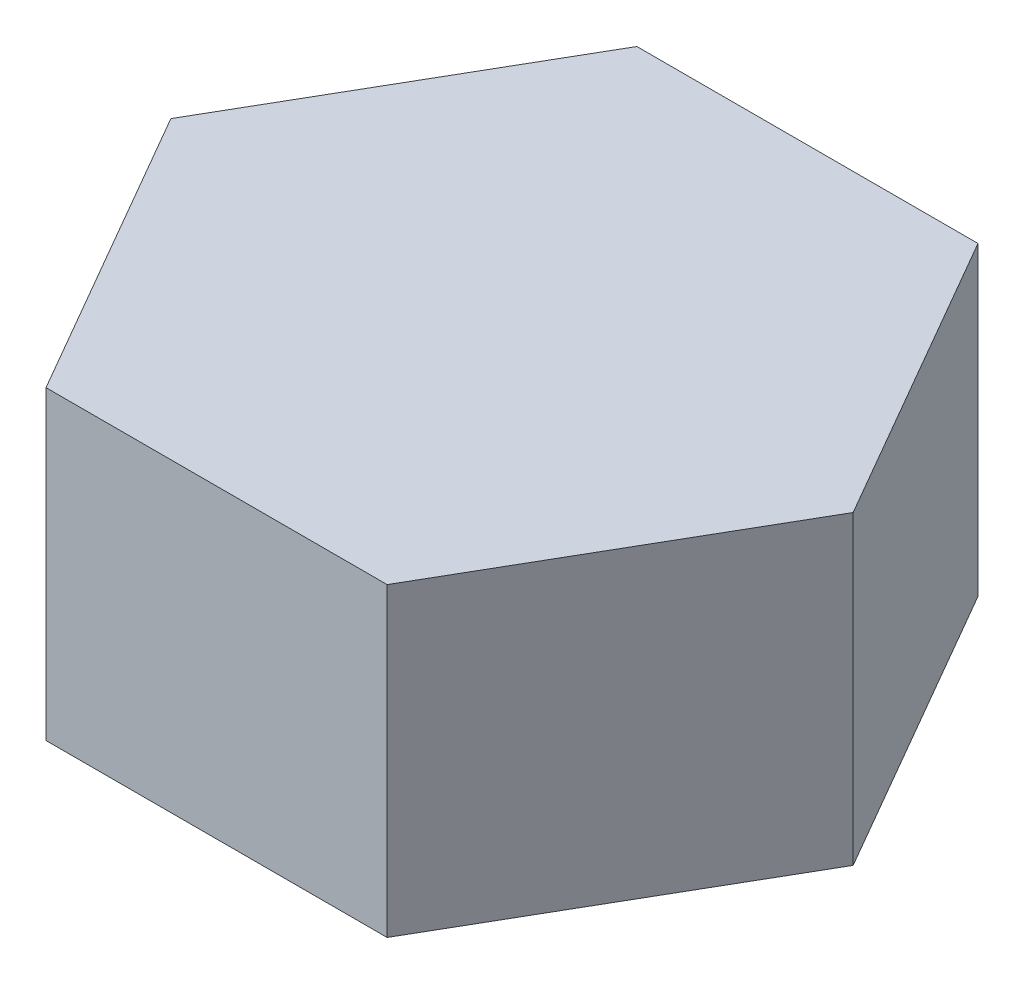
ISO-10303-21;
HEADER;
FILE_DESCRIPTION(('STEP AP214'),'2;1');
FILE_NAME('part.step','',(''),(''),'','','');
FILE_SCHEMA(('AUTOMOTIVE_DESIGN { 1 0 10303 214 1 1 1 1 }'));
ENDSEC;
DATA;
#1=APPLICATION_CONTEXT('core data for automotive mechanical design processes');
#2=APPLICATION_PROTOCOL_DEFINITION('international standard','automotive_design',2000,#1);
#3=PRODUCT_CONTEXT('',#1,'mechanical');
#4=PRODUCT('Part','Part','',(#3));
#5=PRODUCT_RELATED_PRODUCT_CATEGORY('part','',(#4));
#6=PRODUCT_DEFINITION_FORMATION('','',#4);
#7=PRODUCT_DEFINITION_CONTEXT('part definition',#1,'design');
#8=PRODUCT_DEFINITION('design','',#6,#7);
#9=PRODUCT_DEFINITION_SHAPE('','',#8);
#10=(LENGTH_UNIT() NAMED_UNIT(*) SI_UNIT(.MILLI.,.METRE.));
#11=(NAMED_UNIT(*) PLANE_ANGLE_UNIT() SI_UNIT($,.RADIAN.));
#12=(NAMED_UNIT(*) SI_UNIT($,.STERADIAN.) SOLID_ANGLE_UNIT());
#13=UNCERTAINTY_MEASURE_WITH_UNIT(LENGTH_MEASURE(1.E-05),#10,'distance_accuracy_value','');
#14=(GEOMETRIC_REPRESENTATION_CONTEXT(3) GLOBAL_UNCERTAINTY_ASSIGNED_CONTEXT((#13)) GLOBAL_UNIT_ASSIGNED_CONTEXT((#10,
#11,#12)) REPRESENTATION_CONTEXT('',''));
#15=CARTESIAN_POINT('',(0.,0.,0.));
#16=DIRECTION('',(0.,0.,1.));
#17=DIRECTION('',(1.,0.,0.));
#18=AXIS2_PLACEMENT_3D('',#15,#16,#17);
#19=CARTESIAN_POINT('',(-200.,0.,0.));
#20=DIRECTION('',(0.,1.,0.));
#21=DIRECTION('',(0.,0.,1.));
#22=AXIS2_PLACEMENT_3D('',#19,#20,#21);
#23=PLANE('',#22);
#24=DIRECTION('',(0.5,0.,-0.866025403784439));
#25=VECTOR('',#24,1.);
#26=CARTESIAN_POINT('',(-41.8578945162482,0.,-72.5));
#27=LINE('',#26,#25);
#28=CARTESIAN_POINT('',(-83.715789032496,0.,0.));
#29=VERTEX_POINT('',#28);
#30=CARTESIAN_POINT('',(-41.8578945162482,0.,-72.5));
#31=VERTEX_POINT('',#30);
#32=EDGE_CURVE('E50',#29,#31,#27,.T.);
#33=ORIENTED_EDGE('',*,*,#32,.T.);
#34=DIRECTION('',(1.,0.,0.));
#35=VECTOR('',#34,1.);
#36=CARTESIAN_POINT('',(41.8578945162476,0.,-72.5));
#37=LINE('',#36,#35);
#38=CARTESIAN_POINT('',(41.8578945162476,0.,-72.5));
#39=VERTEX_POINT('',#38);
#40=EDGE_CURVE('E220',#31,#39,#37,.T.);
#41=ORIENTED_EDGE('',*,*,#40,.T.);
#42=DIRECTION('',(0.5,0.,0.866025403784439));
#43=VECTOR('',#42,1.);
#44=CARTESIAN_POINT('',(83.7157890324954,0.,0.));
#45=LINE('',#44,#43);
#46=CARTESIAN_POINT('',(83.7157890324954,0.,0.));
#47=VERTEX_POINT('',#46);
#48=EDGE_CURVE('E217',#39,#47,#45,.T.);
#49=ORIENTED_EDGE('',*,*,#48,.T.);
#50=DIRECTION('',(-0.5,0.,0.866025403784439));
#51=VECTOR('',#50,1.);
#52=CARTESIAN_POINT('',(41.8578945162476,0.,72.5));
#53=LINE('',#52,#51);
#54=CARTESIAN_POINT('',(41.8578945162476,0.,72.5));
#55=VERTEX_POINT('',#54);
#56=EDGE_CURVE('E66',#47,#55,#53,.T.);
#57=ORIENTED_EDGE('',*,*,#56,.T.);
#58=DIRECTION('',(-1.,0.,0.));
#59=VECTOR('',#58,1.);
#60=CARTESIAN_POINT('',(-41.8578945162482,0.,72.5));
#61=LINE('',#60,#59);
#62=CARTESIAN_POINT('',(-41.8578945162482,0.,72.5));
#63=VERTEX_POINT('',#62);
#64=EDGE_CURVE('E211',#55,#63,#61,.T.);
#65=ORIENTED_EDGE('',*,*,#64,.T.);
#66=DIRECTION('',(-0.5,0.,-0.866025403784439));
#67=VECTOR('',#66,1.);
#68=CARTESIAN_POINT('',(-83.715789032496,0.,0.));
#69=LINE('',#68,#67);
#70=EDGE_CURVE('E11',#63,#29,#69,.T.);
#71=ORIENTED_EDGE('',*,*,#70,.T.);
#72=EDGE_LOOP('',(#33,#41,#49,#57,#65,#71));
#73=FACE_BOUND('',#72,.T.);
#74=DIRECTION('',(0.499999999999999,0.,-0.866025403784439));
#75=VECTOR('',#74,1.);
#76=CARTESIAN_POINT('',(36.0843918243516,0.,62.5));
#77=LINE('',#76,#75);
#78=CARTESIAN_POINT('',(36.0843918243516,0.,62.5));
#79=VERTEX_POINT('',#78);
#80=CARTESIAN_POINT('',(72.1687836487032,0.,0.));
#81=VERTEX_POINT('',#80);
#82=EDGE_CURVE('E57',#79,#81,#77,.T.);
#83=ORIENTED_EDGE('',*,*,#82,.T.);
#84=DIRECTION('',(-0.5,0.,-0.866025403784438));
#85=VECTOR('',#84,1.);
#86=CARTESIAN_POINT('',(72.1687836487032,0.,0.));
#87=LINE('',#86,#85);
#88=CARTESIAN_POINT('',(36.0843918243516,0.,-62.5));
#89=VERTEX_POINT('',#88);
#90=EDGE_CURVE('E590',#81,#89,#87,.T.);
#91=ORIENTED_EDGE('',*,*,#90,.T.);
#92=DIRECTION('',(-1.,0.,0.));
#93=VECTOR('',#92,1.);
#94=CARTESIAN_POINT('',(36.0843918243516,0.,-62.5));
#95=LINE('',#94,#93);
#96=CARTESIAN_POINT('',(-36.0843918243516,0.,-62.5));
#97=VERTEX_POINT('',#96);
#98=EDGE_CURVE('E586',#89,#97,#95,.T.);
#99=ORIENTED_EDGE('',*,*,#98,.T.);
#100=DIRECTION('',(-0.499999999999999,0.,0.866025403784439));
#101=VECTOR('',#100,1.);
#102=CARTESIAN_POINT('',(-36.0843918243516,0.,-62.5));
#103=LINE('',#102,#101);
#104=CARTESIAN_POINT('',(-72.1687836487032,0.,0.));
#105=VERTEX_POINT('',#104);
#106=EDGE_CURVE('E582',#97,#105,#103,.T.);
#107=ORIENTED_EDGE('',*,*,#106,.T.);
#108=DIRECTION('',(0.5,0.,0.866025403784438));
#109=VECTOR('',#108,1.);
#110=CARTESIAN_POINT('',(-72.1687836487032,0.,0.));
#111=LINE('',#110,#109);
#112=CARTESIAN_POINT('',(-36.0843918243516,0.,62.5));
#113=VERTEX_POINT('',#112);
#114=EDGE_CURVE('E578',#105,#113,#111,.T.);
#115=ORIENTED_EDGE('',*,*,#114,.T.);
#116=DIRECTION('',(1.,0.,0.));
#117=VECTOR('',#116,1.);
#118=CARTESIAN_POINT('',(-36.0843918243516,0.,62.5));
#119=LINE('',#118,#117);
#120=EDGE_CURVE('E141',#113,#79,#119,.T.);
#121=ORIENTED_EDGE('',*,*,#120,.T.);
#122=EDGE_LOOP('',(#83,#91,#99,#107,#115,#121));
#123=FACE_BOUND('',#122,.T.);
#124=ADVANCED_FACE('F41',(#73,#123),#23,.F.);
#125=CARTESIAN_POINT('',(-41.8578945162482,-221.491158589532,-72.5));
#126=DIRECTION('',(-0.866025403784438,0.,-0.5));
#127=DIRECTION('',(-0.5,0.,0.866025403784439));
#128=AXIS2_PLACEMENT_3D('',#125,#126,#127);
#129=PLANE('',#128);
#130=ORIENTED_EDGE('',*,*,#32,.F.);
#131=DIRECTION('',(0.,1.,0.));
#132=VECTOR('',#131,1.);
#133=CARTESIAN_POINT('',(-83.715789032496,-221.491158589532,0.));
#134=LINE('',#133,#132);
#135=CARTESIAN_POINT('',(-83.715789032496,75.,0.));
#136=VERTEX_POINT('',#135);
#137=EDGE_CURVE('E210',#29,#136,#134,.T.);
#138=ORIENTED_EDGE('',*,*,#137,.T.);
#139=DIRECTION('',(-0.5,0.,0.866025403784438));
#140=VECTOR('',#139,1.);
#141=CARTESIAN_POINT('',(-41.8578945162482,75.,-72.5));
#142=LINE('',#141,#140);
#143=CARTESIAN_POINT('',(-41.8578945162482,75.,-72.5));
#144=VERTEX_POINT('',#143);
#145=EDGE_CURVE('E185',#144,#136,#142,.T.);
#146=ORIENTED_EDGE('',*,*,#145,.F.);
#147=DIRECTION('',(0.,1.,0.));
#148=VECTOR('',#147,1.);
#149=CARTESIAN_POINT('',(-41.8578945162482,-221.491158589532,-72.5));
#150=LINE('',#149,#148);
#151=EDGE_CURVE('E214',#31,#144,#150,.T.);
#152=ORIENTED_EDGE('',*,*,#151,.F.);
#153=EDGE_LOOP('',(#130,#138,#146,#152));
#154=FACE_BOUND('',#153,.T.);
#155=ADVANCED_FACE('F43',(#154),#129,.T.);
#156=CARTESIAN_POINT('',(41.8578945162476,-221.491158589532,-72.5));
#157=DIRECTION('',(0.,0.,-1.));
#158=DIRECTION('',(-1.,0.,0.));
#159=AXIS2_PLACEMENT_3D('',#156,#157,#158);
#160=PLANE('',#159);
#161=ORIENTED_EDGE('',*,*,#40,.F.);
#162=ORIENTED_EDGE('',*,*,#151,.T.);
#163=DIRECTION('',(-1.,0.,0.));
#164=VECTOR('',#163,1.);
#165=CARTESIAN_POINT('',(41.8578945162476,75.,-72.5));
#166=LINE('',#165,#164);
#167=CARTESIAN_POINT('',(41.8578945162476,75.,-72.5));
#168=VERTEX_POINT('',#167);
#169=EDGE_CURVE('E206',#168,#144,#166,.T.);
#170=ORIENTED_EDGE('',*,*,#169,.F.);
#171=DIRECTION('',(0.,1.,0.));
#172=VECTOR('',#171,1.);
#173=CARTESIAN_POINT('',(41.8578945162476,-221.491158589532,-72.5));
#174=LINE('',#173,#172);
#175=EDGE_CURVE('E227',#39,#168,#174,.T.);
#176=ORIENTED_EDGE('',*,*,#175,.F.);
#177=EDGE_LOOP('',(#161,#162,#170,#176));
#178=FACE_BOUND('',#177,.T.);
#179=ADVANCED_FACE('F254',(#178),#160,.T.);
#180=CARTESIAN_POINT('',(83.7157890324954,-221.491158589532,0.));
#181=DIRECTION('',(0.866025403784439,0.,-0.5));
#182=DIRECTION('',(-0.5,0.,-0.866025403784439));
#183=AXIS2_PLACEMENT_3D('',#180,#181,#182);
#184=PLANE('',#183);
#185=ORIENTED_EDGE('',*,*,#48,.F.);
#186=ORIENTED_EDGE('',*,*,#175,.T.);
#187=DIRECTION('',(-0.5,0.,-0.866025403784439));
#188=VECTOR('',#187,1.);
#189=CARTESIAN_POINT('',(83.7157890324954,75.,0.));
#190=LINE('',#189,#188);
#191=CARTESIAN_POINT('',(83.7157890324954,75.,0.));
#192=VERTEX_POINT('',#191);
#193=EDGE_CURVE('E202',#192,#168,#190,.T.);
#194=ORIENTED_EDGE('',*,*,#193,.F.);
#195=DIRECTION('',(0.,1.,0.));
#196=VECTOR('',#195,1.);
#197=CARTESIAN_POINT('',(83.7157890324954,-221.491158589532,0.));
#198=LINE('',#197,#196);
#199=EDGE_CURVE('E230',#47,#192,#198,.T.);
#200=ORIENTED_EDGE('',*,*,#199,.F.);
#201=EDGE_LOOP('',(#185,#186,#194,#200));
#202=FACE_BOUND('',#201,.T.);
#203=ADVANCED_FACE('F259',(#202),#184,.T.);
#204=CARTESIAN_POINT('',(41.8578945162476,-221.491158589532,72.5));
#205=DIRECTION('',(0.866025403784439,0.,0.5));
#206=DIRECTION('',(0.5,0.,-0.866025403784439));
#207=AXIS2_PLACEMENT_3D('',#204,#205,#206);
#208=PLANE('',#207);
#209=ORIENTED_EDGE('',*,*,#56,.F.);
#210=ORIENTED_EDGE('',*,*,#199,.T.);
#211=DIRECTION('',(0.5,0.,-0.866025403784439));
#212=VECTOR('',#211,1.);
#213=CARTESIAN_POINT('',(41.8578945162476,75.,72.5));
#214=LINE('',#213,#212);
#215=CARTESIAN_POINT('',(41.8578945162476,75.,72.5));
#216=VERTEX_POINT('',#215);
#217=EDGE_CURVE('E198',#216,#192,#214,.T.);
#218=ORIENTED_EDGE('',*,*,#217,.F.);
#219=DIRECTION('',(0.,1.,0.));
#220=VECTOR('',#219,1.);
#221=CARTESIAN_POINT('',(41.8578945162476,-221.491158589532,72.5));
#222=LINE('',#221,#220);
#223=EDGE_CURVE('E233',#55,#216,#222,.T.);
#224=ORIENTED_EDGE('',*,*,#223,.F.);
#225=EDGE_LOOP('',(#209,#210,#218,#224));
#226=FACE_BOUND('',#225,.T.);
#227=ADVANCED_FACE('F262',(#226),#208,.T.);
#228=CARTESIAN_POINT('',(-41.8578945162482,-221.491158589532,72.5));
#229=DIRECTION('',(0.,0.,1.));
#230=DIRECTION('',(1.,0.,0.));
#231=AXIS2_PLACEMENT_3D('',#228,#229,#230);
#232=PLANE('',#231);
#233=ORIENTED_EDGE('',*,*,#64,.F.);
#234=ORIENTED_EDGE('',*,*,#223,.T.);
#235=DIRECTION('',(1.,0.,0.));
#236=VECTOR('',#235,1.);
#237=CARTESIAN_POINT('',(-41.8578945162482,75.,72.5));
#238=LINE('',#237,#236);
#239=CARTESIAN_POINT('',(-41.8578945162482,75.,72.5));
#240=VERTEX_POINT('',#239);
#241=EDGE_CURVE('E194',#240,#216,#238,.T.);
#242=ORIENTED_EDGE('',*,*,#241,.F.);
#243=DIRECTION('',(0.,1.,0.));
#244=VECTOR('',#243,1.);
#245=CARTESIAN_POINT('',(-41.8578945162482,-221.491158589532,72.5));
#246=LINE('',#245,#244);
#247=EDGE_CURVE('E236',#63,#240,#246,.T.);
#248=ORIENTED_EDGE('',*,*,#247,.F.);
#249=EDGE_LOOP('',(#233,#234,#242,#248));
#250=FACE_BOUND('',#249,.T.);
#251=ADVANCED_FACE('F265',(#250),#232,.T.);
#252=CARTESIAN_POINT('',(-83.715789032496,-221.491158589532,0.));
#253=DIRECTION('',(-0.866025403784439,0.,0.5));
#254=DIRECTION('',(0.5,0.,0.866025403784439));
#255=AXIS2_PLACEMENT_3D('',#252,#253,#254);
#256=PLANE('',#255);
#257=ORIENTED_EDGE('',*,*,#70,.F.);
#258=ORIENTED_EDGE('',*,*,#247,.T.);
#259=DIRECTION('',(0.5,0.,0.866025403784439));
#260=VECTOR('',#259,1.);
#261=CARTESIAN_POINT('',(-83.715789032496,75.,0.));
#262=LINE('',#261,#260);
#263=EDGE_CURVE('E189',#136,#240,#262,.T.);
#264=ORIENTED_EDGE('',*,*,#263,.F.);
#265=ORIENTED_EDGE('',*,*,#137,.F.);
#266=EDGE_LOOP('',(#257,#258,#264,#265));
#267=FACE_BOUND('',#266,.T.);
#268=ADVANCED_FACE('F245',(#267),#256,.T.);
#269=CARTESIAN_POINT('',(-200.,75.,0.));
#270=DIRECTION('',(0.,1.,0.));
#271=DIRECTION('',(0.,0.,1.));
#272=AXIS2_PLACEMENT_3D('',#269,#270,#271);
#273=PLANE('',#272);
#274=ORIENTED_EDGE('',*,*,#145,.T.);
#275=ORIENTED_EDGE('',*,*,#263,.T.);
#276=ORIENTED_EDGE('',*,*,#241,.T.);
#277=ORIENTED_EDGE('',*,*,#217,.T.);
#278=ORIENTED_EDGE('',*,*,#193,.T.);
#279=ORIENTED_EDGE('',*,*,#169,.T.);
#280=EDGE_LOOP('',(#274,#275,#276,#277,#278,#279));
#281=FACE_BOUND('',#280,.T.);
#282=ADVANCED_FACE('F249',(#281),#273,.T.);
#283=CARTESIAN_POINT('',(0.,55.,0.));
#284=DIRECTION('',(0.,1.,0.));
#285=DIRECTION('',(0.,0.,1.));
#286=AXIS2_PLACEMENT_3D('',#283,#284,#285);
#287=PLANE('',#286);
#288=CARTESIAN_POINT('',(31.25,55.,-54.1265877365274));
#289=DIRECTION('',(0.,1.,0.));
#290=DIRECTION('',(0.,0.,1.));
#291=AXIS2_PLACEMENT_3D('',#288,#289,#290);
#292=CIRCLE('',#291,4.50000000000001);
#293=CARTESIAN_POINT('',(31.25,55.,-49.6265877365274));
#294=VERTEX_POINT('',#293);
#295=EDGE_CURVE('E536',#294,#294,#292,.T.);
#296=ORIENTED_EDGE('',*,*,#295,.T.);
#297=EDGE_LOOP('',(#296));
#298=FACE_BOUND('',#297,.T.);
#299=CARTESIAN_POINT('',(-31.25,55.,-54.1265877365274));
#300=DIRECTION('',(0.,1.,0.));
#301=DIRECTION('',(0.,0.,1.));
#302=AXIS2_PLACEMENT_3D('',#299,#300,#301);
#303=CIRCLE('',#302,4.50000000000001);
#304=CARTESIAN_POINT('',(-31.25,55.,-49.6265877365274));
#305=VERTEX_POINT('',#304);
#306=EDGE_CURVE('E535',#305,#305,#303,.T.);
#307=ORIENTED_EDGE('',*,*,#306,.T.);
#308=EDGE_LOOP('',(#307));
#309=FACE_BOUND('',#308,.T.);
#310=CARTESIAN_POINT('',(-62.5,55.,0.));
#311=DIRECTION('',(0.,1.,0.));
#312=DIRECTION('',(0.,0.,1.));
#313=AXIS2_PLACEMENT_3D('',#310,#311,#312);
#314=CIRCLE('',#313,4.50000000000001);
#315=CARTESIAN_POINT('',(-62.5,55.,4.50000000000002));
#316=VERTEX_POINT('',#315);
#317=EDGE_CURVE('E548',#316,#316,#314,.T.);
#318=ORIENTED_EDGE('',*,*,#317,.T.);
#319=EDGE_LOOP('',(#318));
#320=FACE_BOUND('',#319,.T.);
#321=CARTESIAN_POINT('',(-31.25,55.,54.1265877365274));
#322=DIRECTION('',(0.,1.,0.));
#323=DIRECTION('',(0.,0.,1.));
#324=AXIS2_PLACEMENT_3D('',#321,#322,#323);
#325=CIRCLE('',#324,4.50000000000002);
#326=CARTESIAN_POINT('',(-31.25,55.,58.6265877365274));
#327=VERTEX_POINT('',#326);
#328=EDGE_CURVE('E554',#327,#327,#325,.T.);
#329=ORIENTED_EDGE('',*,*,#328,.T.);
#330=EDGE_LOOP('',(#329));
#331=FACE_BOUND('',#330,.T.);
#332=CARTESIAN_POINT('',(31.25,55.,54.1265877365274));
#333=DIRECTION('',(0.,1.,0.));
#334=DIRECTION('',(0.,0.,1.));
#335=AXIS2_PLACEMENT_3D('',#332,#333,#334);
#336=CIRCLE('',#335,4.50000000000001);
#337=CARTESIAN_POINT('',(31.25,55.,58.6265877365274));
#338=VERTEX_POINT('',#337);
#339=EDGE_CURVE('E562',#338,#338,#336,.T.);
#340=ORIENTED_EDGE('',*,*,#339,.T.);
#341=EDGE_LOOP('',(#340));
#342=FACE_BOUND('',#341,.T.);
#343=CARTESIAN_POINT('',(62.5,55.,0.));
#344=DIRECTION('',(0.,1.,0.));
#345=DIRECTION('',(0.,0.,1.));
#346=AXIS2_PLACEMENT_3D('',#343,#344,#345);
#347=CIRCLE('',#346,4.5);
#348=CARTESIAN_POINT('',(62.5,55.,4.5));
#349=VERTEX_POINT('',#348);
#350=EDGE_CURVE('E167',#349,#349,#347,.T.);
#351=ORIENTED_EDGE('',*,*,#350,.T.);
#352=EDGE_LOOP('',(#351));
#353=FACE_BOUND('',#352,.T.);
#354=DIRECTION('',(1.,0.,0.));
#355=VECTOR('',#354,1.);
#356=CARTESIAN_POINT('',(-36.0843918243516,55.,62.5));
#357=LINE('',#356,#355);
#358=CARTESIAN_POINT('',(-36.0843918243516,55.,62.5));
#359=VERTEX_POINT('',#358);
#360=CARTESIAN_POINT('',(36.0843918243516,55.,62.5));
#361=VERTEX_POINT('',#360);
#362=EDGE_CURVE('E149',#359,#361,#357,.T.);
#363=ORIENTED_EDGE('',*,*,#362,.F.);
#364=DIRECTION('',(0.5,0.,0.866025403784439));
#365=VECTOR('',#364,1.);
#366=CARTESIAN_POINT('',(-72.1687836487032,55.,0.));
#367=LINE('',#366,#365);
#368=CARTESIAN_POINT('',(-72.1687836487032,55.,0.));
#369=VERTEX_POINT('',#368);
#370=EDGE_CURVE('E159',#369,#359,#367,.T.);
#371=ORIENTED_EDGE('',*,*,#370,.F.);
#372=DIRECTION('',(-0.499999999999999,0.,0.866025403784439));
#373=VECTOR('',#372,1.);
#374=CARTESIAN_POINT('',(-36.0843918243516,55.,-62.5));
#375=LINE('',#374,#373);
#376=CARTESIAN_POINT('',(-36.0843918243516,55.,-62.5));
#377=VERTEX_POINT('',#376);
#378=EDGE_CURVE('E164',#377,#369,#375,.T.);
#379=ORIENTED_EDGE('',*,*,#378,.F.);
#380=DIRECTION('',(-1.,0.,0.));
#381=VECTOR('',#380,1.);
#382=CARTESIAN_POINT('',(36.0843918243516,55.,-62.5));
#383=LINE('',#382,#381);
#384=CARTESIAN_POINT('',(36.0843918243516,55.,-62.5));
#385=VERTEX_POINT('',#384);
#386=EDGE_CURVE('E604',#385,#377,#383,.T.);
#387=ORIENTED_EDGE('',*,*,#386,.F.);
#388=DIRECTION('',(-0.5,0.,-0.866025403784438));
#389=VECTOR('',#388,1.);
#390=CARTESIAN_POINT('',(72.1687836487032,55.,0.));
#391=LINE('',#390,#389);
#392=CARTESIAN_POINT('',(72.1687836487032,55.,0.));
#393=VERTEX_POINT('',#392);
#394=EDGE_CURVE('E152',#393,#385,#391,.T.);
#395=ORIENTED_EDGE('',*,*,#394,.F.);
#396=DIRECTION('',(0.499999999999999,0.,-0.866025403784439));
#397=VECTOR('',#396,1.);
#398=CARTESIAN_POINT('',(36.0843918243516,55.,62.5));
#399=LINE('',#398,#397);
#400=EDGE_CURVE('E134',#361,#393,#399,.T.);
#401=ORIENTED_EDGE('',*,*,#400,.F.);
#402=EDGE_LOOP('',(#363,#371,#379,#387,#395,#401));
#403=FACE_BOUND('',#402,.T.);
#404=CARTESIAN_POINT('',(0.,55.,0.));
#405=DIRECTION('',(0.,1.,0.));
#406=DIRECTION('',(0.,0.,1.));
#407=AXIS2_PLACEMENT_3D('',#404,#405,#406);
#408=CIRCLE('',#407,54.8709661048334);
#409=CARTESIAN_POINT('',(0.,55.,54.8709661048334));
#410=VERTEX_POINT('',#409);
#411=EDGE_CURVE('E154',#410,#410,#408,.T.);
#412=ORIENTED_EDGE('',*,*,#411,.T.);
#413=EDGE_LOOP('',(#412));
#414=FACE_BOUND('',#413,.T.);
#415=ADVANCED_FACE('F146',(#298,#309,#320,#331,#342,#353,#403,#414),#287,.F.);
#416=CARTESIAN_POINT('',(0.,7.53049234040404,0.));
#417=DIRECTION('',(0.,1.,0.));
#418=DIRECTION('',(0.,0.,1.));
#419=AXIS2_PLACEMENT_3D('',#416,#417,#418);
#420=PLANE('',#419);
#421=CARTESIAN_POINT('',(0.,7.53049234040402,0.));
#422=DIRECTION('',(0.,1.,0.));
#423=DIRECTION('',(0.,0.,1.));
#424=AXIS2_PLACEMENT_3D('',#421,#422,#423);
#425=CIRCLE('',#424,20.);
#426=CARTESIAN_POINT('',(0.,7.53049234040402,20.));
#427=VERTEX_POINT('',#426);
#428=EDGE_CURVE('E190',#427,#427,#425,.T.);
#429=ORIENTED_EDGE('',*,*,#428,.F.);
#430=EDGE_LOOP('',(#429));
#431=FACE_BOUND('',#430,.T.);
#432=ADVANCED_FACE('F314',(#431),#420,.F.);
#433=CARTESIAN_POINT('',(0.,58.765246170202,0.));
#434=DIRECTION('',(0.,1.,0.));
#435=DIRECTION('',(0.,0.,-1.));
#436=AXIS2_PLACEMENT_3D('',#433,#434,#435);
#437=SPHERICAL_SURFACE('',#436,55.);
#438=ORIENTED_EDGE('',*,*,#428,.T.);
#439=EDGE_LOOP('',(#438));
#440=FACE_BOUND('',#439,.T.);
#441=ORIENTED_EDGE('',*,*,#411,.F.);
#442=EDGE_LOOP('',(#441));
#443=FACE_BOUND('',#442,.T.);
#444=ADVANCED_FACE('F326',(#440,#443),#437,.T.);
#445=CARTESIAN_POINT('',(36.0843918243516,110.,62.5));
#446=DIRECTION('',(-0.866025403784439,0.,-0.499999999999999));
#447=DIRECTION('',(-0.499999999999999,0.,0.866025403784439));
#448=AXIS2_PLACEMENT_3D('',#445,#446,#447);
#449=PLANE('',#448);
#450=ORIENTED_EDGE('',*,*,#400,.T.);
#451=DIRECTION('',(0.,-1.,0.));
#452=VECTOR('',#451,1.);
#453=CARTESIAN_POINT('',(72.1687836487032,110.,0.));
#454=LINE('',#453,#452);
#455=EDGE_CURVE('E171',#393,#81,#454,.T.);
#456=ORIENTED_EDGE('',*,*,#455,.T.);
#457=ORIENTED_EDGE('',*,*,#82,.F.);
#458=DIRECTION('',(0.,-1.,0.));
#459=VECTOR('',#458,1.);
#460=CARTESIAN_POINT('',(36.0843918243516,110.,62.5));
#461=LINE('',#460,#459);
#462=EDGE_CURVE('E131',#361,#79,#461,.T.);
#463=ORIENTED_EDGE('',*,*,#462,.F.);
#464=EDGE_LOOP('',(#450,#456,#457,#463));
#465=FACE_BOUND('',#464,.T.);
#466=ADVANCED_FACE('F133',(#465),#449,.T.);
#467=CARTESIAN_POINT('',(72.1687836487032,110.,0.));
#468=DIRECTION('',(-0.866025403784438,0.,0.5));
#469=DIRECTION('',(0.5,0.,0.866025403784438));
#470=AXIS2_PLACEMENT_3D('',#467,#468,#469);
#471=PLANE('',#470);
#472=ORIENTED_EDGE('',*,*,#394,.T.);
#473=DIRECTION('',(0.,-1.,0.));
#474=VECTOR('',#473,1.);
#475=CARTESIAN_POINT('',(36.0843918243516,110.,-62.5));
#476=LINE('',#475,#474);
#477=EDGE_CURVE('E174',#385,#89,#476,.T.);
#478=ORIENTED_EDGE('',*,*,#477,.T.);
#479=ORIENTED_EDGE('',*,*,#90,.F.);
#480=ORIENTED_EDGE('',*,*,#455,.F.);
#481=EDGE_LOOP('',(#472,#478,#479,#480));
#482=FACE_BOUND('',#481,.T.);
#483=ADVANCED_FACE('F347',(#482),#471,.T.);
#484=CARTESIAN_POINT('',(36.0843918243516,110.,-62.5));
#485=DIRECTION('',(0.,0.,1.));
#486=DIRECTION('',(1.,0.,0.));
#487=AXIS2_PLACEMENT_3D('',#484,#485,#486);
#488=PLANE('',#487);
#489=ORIENTED_EDGE('',*,*,#386,.T.);
#490=DIRECTION('',(0.,-1.,0.));
#491=VECTOR('',#490,1.);
#492=CARTESIAN_POINT('',(-36.0843918243516,110.,-62.5));
#493=LINE('',#492,#491);
#494=EDGE_CURVE('E177',#377,#97,#493,.T.);
#495=ORIENTED_EDGE('',*,*,#494,.T.);
#496=ORIENTED_EDGE('',*,*,#98,.F.);
#497=ORIENTED_EDGE('',*,*,#477,.F.);
#498=EDGE_LOOP('',(#489,#495,#496,#497));
#499=FACE_BOUND('',#498,.T.);
#500=ADVANCED_FACE('F357',(#499),#488,.T.);
#501=CARTESIAN_POINT('',(-36.0843918243516,110.,-62.5));
#502=DIRECTION('',(0.866025403784439,0.,0.499999999999999));
#503=DIRECTION('',(0.499999999999999,0.,-0.866025403784439));
#504=AXIS2_PLACEMENT_3D('',#501,#502,#503);
#505=PLANE('',#504);
#506=ORIENTED_EDGE('',*,*,#378,.T.);
#507=DIRECTION('',(0.,-1.,0.));
#508=VECTOR('',#507,1.);
#509=CARTESIAN_POINT('',(-72.1687836487032,110.,0.));
#510=LINE('',#509,#508);
#511=EDGE_CURVE('E180',#369,#105,#510,.T.);
#512=ORIENTED_EDGE('',*,*,#511,.T.);
#513=ORIENTED_EDGE('',*,*,#106,.F.);
#514=ORIENTED_EDGE('',*,*,#494,.F.);
#515=EDGE_LOOP('',(#506,#512,#513,#514));
#516=FACE_BOUND('',#515,.T.);
#517=ADVANCED_FACE('F368',(#516),#505,.T.);
#518=CARTESIAN_POINT('',(-72.1687836487032,110.,0.));
#519=DIRECTION('',(0.866025403784439,0.,-0.5));
#520=DIRECTION('',(-0.5,0.,-0.866025403784439));
#521=AXIS2_PLACEMENT_3D('',#518,#519,#520);
#522=PLANE('',#521);
#523=ORIENTED_EDGE('',*,*,#370,.T.);
#524=DIRECTION('',(0.,-1.,0.));
#525=VECTOR('',#524,1.);
#526=CARTESIAN_POINT('',(-36.0843918243516,110.,62.5));
#527=LINE('',#526,#525);
#528=EDGE_CURVE('E142',#359,#113,#527,.T.);
#529=ORIENTED_EDGE('',*,*,#528,.T.);
#530=ORIENTED_EDGE('',*,*,#114,.F.);
#531=ORIENTED_EDGE('',*,*,#511,.F.);
#532=EDGE_LOOP('',(#523,#529,#530,#531));
#533=FACE_BOUND('',#532,.T.);
#534=ADVANCED_FACE('F379',(#533),#522,.T.);
#535=CARTESIAN_POINT('',(-36.0843918243516,110.,62.5));
#536=DIRECTION('',(0.,0.,-1.));
#537=DIRECTION('',(-1.,0.,0.));
#538=AXIS2_PLACEMENT_3D('',#535,#536,#537);
#539=PLANE('',#538);
#540=ORIENTED_EDGE('',*,*,#362,.T.);
#541=ORIENTED_EDGE('',*,*,#462,.T.);
#542=ORIENTED_EDGE('',*,*,#120,.F.);
#543=ORIENTED_EDGE('',*,*,#528,.F.);
#544=EDGE_LOOP('',(#540,#541,#542,#543));
#545=FACE_BOUND('',#544,.T.);
#546=ADVANCED_FACE('F156',(#545),#539,.T.);
#547=CARTESIAN_POINT('',(62.5,65.,0.));
#548=DIRECTION('',(0.,-1.,0.));
#549=DIRECTION('',(0.,0.,-1.));
#550=AXIS2_PLACEMENT_3D('',#547,#548,#549);
#551=CYLINDRICAL_SURFACE('',#550,4.5);
#552=CARTESIAN_POINT('',(62.5,65.,0.));
#553=DIRECTION('',(0.,1.,0.));
#554=DIRECTION('',(0.,0.,1.));
#555=AXIS2_PLACEMENT_3D('',#552,#553,#554);
#556=CIRCLE('',#555,4.5);
#557=CARTESIAN_POINT('',(62.5,65.,4.5));
#558=VERTEX_POINT('',#557);
#559=EDGE_CURVE('E160',#558,#558,#556,.T.);
#560=ORIENTED_EDGE('',*,*,#559,.T.);
#561=EDGE_LOOP('',(#560));
#562=FACE_BOUND('',#561,.T.);
#563=ORIENTED_EDGE('',*,*,#350,.F.);
#564=EDGE_LOOP('',(#563));
#565=FACE_BOUND('',#564,.T.);
#566=ADVANCED_FACE('F317',(#562,#565),#551,.F.);
#567=CARTESIAN_POINT('',(62.5,65.,0.));
#568=DIRECTION('',(0.,1.,0.));
#569=DIRECTION('',(0.,0.,1.));
#570=AXIS2_PLACEMENT_3D('',#567,#568,#569);
#571=PLANE('',#570);
#572=ORIENTED_EDGE('',*,*,#559,.F.);
#573=EDGE_LOOP('',(#572));
#574=FACE_BOUND('',#573,.T.);
#575=ADVANCED_FACE('F408',(#574),#571,.F.);
#576=CARTESIAN_POINT('',(31.25,65.,54.1265877365274));
#577=DIRECTION('',(0.,-1.,0.));
#578=DIRECTION('',(0.,0.,-1.));
#579=AXIS2_PLACEMENT_3D('',#576,#577,#578);
#580=CYLINDRICAL_SURFACE('',#579,4.50000000000001);
#581=CARTESIAN_POINT('',(31.25,65.,54.1265877365274));
#582=DIRECTION('',(0.,1.,0.));
#583=DIRECTION('',(0.,0.,1.));
#584=AXIS2_PLACEMENT_3D('',#581,#582,#583);
#585=CIRCLE('',#584,4.50000000000001);
#586=CARTESIAN_POINT('',(31.25,65.,58.6265877365274));
#587=VERTEX_POINT('',#586);
#588=EDGE_CURVE('E566',#587,#587,#585,.T.);
#589=ORIENTED_EDGE('',*,*,#588,.T.);
#590=EDGE_LOOP('',(#589));
#591=FACE_BOUND('',#590,.T.);
#592=ORIENTED_EDGE('',*,*,#339,.F.);
#593=EDGE_LOOP('',(#592));
#594=FACE_BOUND('',#593,.T.);
#595=ADVANCED_FACE('F419',(#591,#594),#580,.F.);
#596=CARTESIAN_POINT('',(31.25,65.,54.1265877365274));
#597=DIRECTION('',(0.,1.,0.));
#598=DIRECTION('',(0.,0.,1.));
#599=AXIS2_PLACEMENT_3D('',#596,#597,#598);
#600=PLANE('',#599);
#601=ORIENTED_EDGE('',*,*,#588,.F.);
#602=EDGE_LOOP('',(#601));
#603=FACE_BOUND('',#602,.T.);
#604=ADVANCED_FACE('F430',(#603),#600,.F.);
#605=CARTESIAN_POINT('',(-31.25,65.,54.1265877365274));
#606=DIRECTION('',(0.,-1.,0.));
#607=DIRECTION('',(0.,0.,-1.));
#608=AXIS2_PLACEMENT_3D('',#605,#606,#607);
#609=CYLINDRICAL_SURFACE('',#608,4.50000000000002);
#610=CARTESIAN_POINT('',(-31.25,65.,54.1265877365274));
#611=DIRECTION('',(0.,1.,0.));
#612=DIRECTION('',(0.,0.,1.));
#613=AXIS2_PLACEMENT_3D('',#610,#611,#612);
#614=CIRCLE('',#613,4.50000000000002);
#615=CARTESIAN_POINT('',(-31.25,65.,58.6265877365274));
#616=VERTEX_POINT('',#615);
#617=EDGE_CURVE('E558',#616,#616,#614,.T.);
#618=ORIENTED_EDGE('',*,*,#617,.T.);
#619=EDGE_LOOP('',(#618));
#620=FACE_BOUND('',#619,.T.);
#621=ORIENTED_EDGE('',*,*,#328,.F.);
#622=EDGE_LOOP('',(#621));
#623=FACE_BOUND('',#622,.T.);
#624=ADVANCED_FACE('F441',(#620,#623),#609,.F.);
#625=CARTESIAN_POINT('',(-31.25,65.,54.1265877365274));
#626=DIRECTION('',(0.,1.,0.));
#627=DIRECTION('',(0.,0.,1.));
#628=AXIS2_PLACEMENT_3D('',#625,#626,#627);
#629=PLANE('',#628);
#630=ORIENTED_EDGE('',*,*,#617,.F.);
#631=EDGE_LOOP('',(#630));
#632=FACE_BOUND('',#631,.T.);
#633=ADVANCED_FACE('F452',(#632),#629,.F.);
#634=CARTESIAN_POINT('',(-62.5,65.,0.));
#635=DIRECTION('',(0.,-1.,0.));
#636=DIRECTION('',(0.,0.,-1.));
#637=AXIS2_PLACEMENT_3D('',#634,#635,#636);
#638=CYLINDRICAL_SURFACE('',#637,4.50000000000001);
#639=CARTESIAN_POINT('',(-62.5,65.,0.));
#640=DIRECTION('',(0.,1.,0.));
#641=DIRECTION('',(0.,0.,1.));
#642=AXIS2_PLACEMENT_3D('',#639,#640,#641);
#643=CIRCLE('',#642,4.50000000000001);
#644=CARTESIAN_POINT('',(-62.5,65.,4.50000000000002));
#645=VERTEX_POINT('',#644);
#646=EDGE_CURVE('E550',#645,#645,#643,.T.);
#647=ORIENTED_EDGE('',*,*,#646,.T.);
#648=EDGE_LOOP('',(#647));
#649=FACE_BOUND('',#648,.T.);
#650=ORIENTED_EDGE('',*,*,#317,.F.);
#651=EDGE_LOOP('',(#650));
#652=FACE_BOUND('',#651,.T.);
#653=ADVANCED_FACE('F463',(#649,#652),#638,.F.);
#654=CARTESIAN_POINT('',(-62.5,65.,0.));
#655=DIRECTION('',(0.,1.,0.));
#656=DIRECTION('',(0.,0.,1.));
#657=AXIS2_PLACEMENT_3D('',#654,#655,#656);
#658=PLANE('',#657);
#659=ORIENTED_EDGE('',*,*,#646,.F.);
#660=EDGE_LOOP('',(#659));
#661=FACE_BOUND('',#660,.T.);
#662=ADVANCED_FACE('F474',(#661),#658,.F.);
#663=CARTESIAN_POINT('',(-31.25,65.,-54.1265877365274));
#664=DIRECTION('',(0.,-1.,0.));
#665=DIRECTION('',(0.,0.,-1.));
#666=AXIS2_PLACEMENT_3D('',#663,#664,#665);
#667=CYLINDRICAL_SURFACE('',#666,4.50000000000001);
#668=CARTESIAN_POINT('',(-31.25,65.,-54.1265877365274));
#669=DIRECTION('',(0.,1.,0.));
#670=DIRECTION('',(0.,0.,1.));
#671=AXIS2_PLACEMENT_3D('',#668,#669,#670);
#672=CIRCLE('',#671,4.50000000000001);
#673=CARTESIAN_POINT('',(-31.25,65.,-49.6265877365274));
#674=VERTEX_POINT('',#673);
#675=EDGE_CURVE('E541',#674,#674,#672,.T.);
#676=ORIENTED_EDGE('',*,*,#675,.T.);
#677=EDGE_LOOP('',(#676));
#678=FACE_BOUND('',#677,.T.);
#679=ORIENTED_EDGE('',*,*,#306,.F.);
#680=EDGE_LOOP('',(#679));
#681=FACE_BOUND('',#680,.T.);
#682=ADVANCED_FACE('F485',(#678,#681),#667,.F.);
#683=CARTESIAN_POINT('',(-31.25,65.,-54.1265877365274));
#684=DIRECTION('',(0.,1.,0.));
#685=DIRECTION('',(0.,0.,1.));
#686=AXIS2_PLACEMENT_3D('',#683,#684,#685);
#687=PLANE('',#686);
#688=ORIENTED_EDGE('',*,*,#675,.F.);
#689=EDGE_LOOP('',(#688));
#690=FACE_BOUND('',#689,.T.);
#691=ADVANCED_FACE('F496',(#690),#687,.F.);
#692=CARTESIAN_POINT('',(31.25,65.,-54.1265877365274));
#693=DIRECTION('',(0.,-1.,0.));
#694=DIRECTION('',(0.,0.,-1.));
#695=AXIS2_PLACEMENT_3D('',#692,#693,#694);
#696=CYLINDRICAL_SURFACE('',#695,4.50000000000001);
#697=CARTESIAN_POINT('',(31.25,65.,-54.1265877365274));
#698=DIRECTION('',(0.,1.,0.));
#699=DIRECTION('',(0.,0.,1.));
#700=AXIS2_PLACEMENT_3D('',#697,#698,#699);
#701=CIRCLE('',#700,4.50000000000001);
#702=CARTESIAN_POINT('',(31.25,65.,-49.6265877365274));
#703=VERTEX_POINT('',#702);
#704=EDGE_CURVE('E533',#703,#703,#701,.T.);
#705=ORIENTED_EDGE('',*,*,#704,.T.);
#706=EDGE_LOOP('',(#705));
#707=FACE_BOUND('',#706,.T.);
#708=ORIENTED_EDGE('',*,*,#295,.F.);
#709=EDGE_LOOP('',(#708));
#710=FACE_BOUND('',#709,.T.);
#711=ADVANCED_FACE('F507',(#707,#710),#696,.F.);
#712=CARTESIAN_POINT('',(31.25,65.,-54.1265877365274));
#713=DIRECTION('',(0.,1.,0.));
#714=DIRECTION('',(0.,0.,1.));
#715=AXIS2_PLACEMENT_3D('',#712,#713,#714);
#716=PLANE('',#715);
#717=ORIENTED_EDGE('',*,*,#704,.F.);
#718=EDGE_LOOP('',(#717));
#719=FACE_BOUND('',#718,.T.);
#720=ADVANCED_FACE('F518',(#719),#716,.F.);
#721=CLOSED_SHELL('',(#124,#155,#179,#203,#227,#251,#268,#282,#415,#432,#444,#466,#483,#500,
#517,#534,#546,#566,#575,#595,#604,#624,#633,#653,#662,#682,#691,#711,#720));
#722=MANIFOLD_SOLID_BREP('B2',#721);
#723=ADVANCED_BREP_SHAPE_REPRESENTATION('',(#18,#722),#14);
#724=SHAPE_DEFINITION_REPRESENTATION(#9,#723);
ENDSEC;
END-ISO-10303-21;
